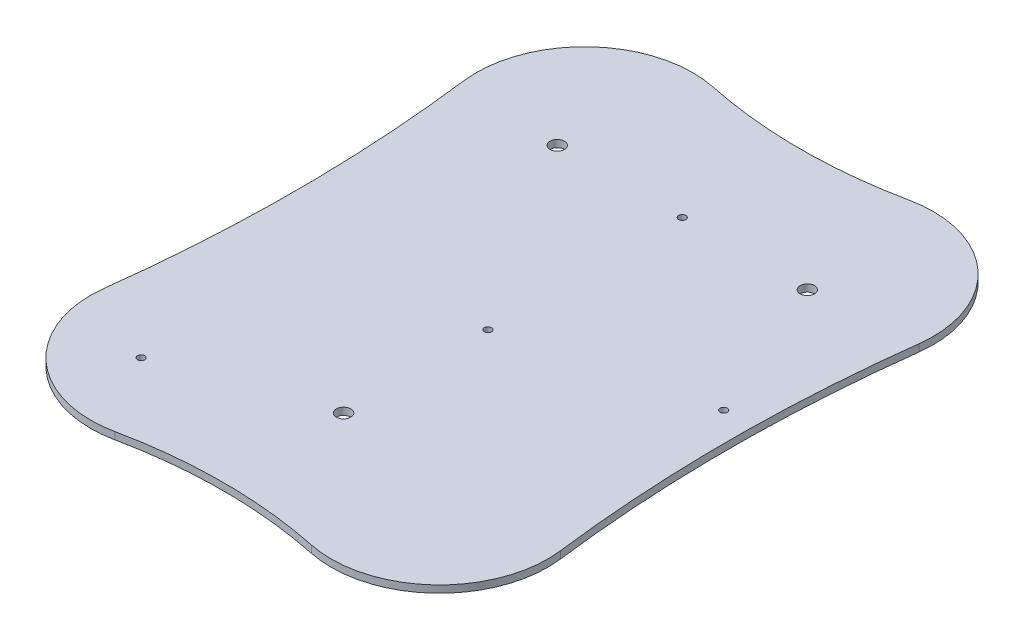
ISO-10303-21;
HEADER;
FILE_DESCRIPTION(('STEP AP214'),'2;1');
FILE_NAME('part.step','',(''),(''),'','','');
FILE_SCHEMA(('AUTOMOTIVE_DESIGN { 1 0 10303 214 1 1 1 1 }'));
ENDSEC;
DATA;
#1=APPLICATION_CONTEXT('core data for automotive mechanical design processes');
#2=APPLICATION_PROTOCOL_DEFINITION('international standard','automotive_design',2000,#1);
#3=PRODUCT_CONTEXT('',#1,'mechanical');
#4=PRODUCT('Part','Part','',(#3));
#5=PRODUCT_RELATED_PRODUCT_CATEGORY('part','',(#4));
#6=PRODUCT_DEFINITION_FORMATION('','',#4);
#7=PRODUCT_DEFINITION_CONTEXT('part definition',#1,'design');
#8=PRODUCT_DEFINITION('design','',#6,#7);
#9=PRODUCT_DEFINITION_SHAPE('','',#8);
#10=(LENGTH_UNIT() NAMED_UNIT(*) SI_UNIT(.MILLI.,.METRE.));
#11=(NAMED_UNIT(*) PLANE_ANGLE_UNIT() SI_UNIT($,.RADIAN.));
#12=(NAMED_UNIT(*) SI_UNIT($,.STERADIAN.) SOLID_ANGLE_UNIT());
#13=UNCERTAINTY_MEASURE_WITH_UNIT(LENGTH_MEASURE(1.E-05),#10,'distance_accuracy_value','');
#14=(GEOMETRIC_REPRESENTATION_CONTEXT(3) GLOBAL_UNCERTAINTY_ASSIGNED_CONTEXT((#13)) GLOBAL_UNIT_ASSIGNED_CONTEXT((#10,
#11,#12)) REPRESENTATION_CONTEXT('',''));
#15=CARTESIAN_POINT('',(0.,0.,0.));
#16=DIRECTION('',(0.,0.,1.));
#17=DIRECTION('',(1.,0.,0.));
#18=AXIS2_PLACEMENT_3D('',#15,#16,#17);
#19=CARTESIAN_POINT('',(-185.000006532533,1.5,25.0390765857744));
#20=DIRECTION('',(0.,-1.,0.));
#21=DIRECTION('',(0.,0.,-1.));
#22=AXIS2_PLACEMENT_3D('',#19,#20,#21);
#23=PLANE('',#22);
#24=CARTESIAN_POINT('',(38.9999999999999,1.5,0.));
#25=DIRECTION('',(0.,1.,0.));
#26=DIRECTION('',(0.,0.,1.));
#27=AXIS2_PLACEMENT_3D('',#24,#25,#26);
#28=CIRCLE('',#27,0.749999999999999);
#29=CARTESIAN_POINT('',(38.9999999999999,1.5,0.749999999999999));
#30=VERTEX_POINT('',#29);
#31=EDGE_CURVE('E214',#30,#30,#28,.T.);
#32=ORIENTED_EDGE('',*,*,#31,.F.);
#33=EDGE_LOOP('',(#32));
#34=FACE_BOUND('',#33,.T.);
#35=CARTESIAN_POINT('',(-31.0104207051516,1.5,51.0885608116344));
#36=DIRECTION('',(0.,1.,0.));
#37=DIRECTION('',(0.,0.,1.));
#38=AXIS2_PLACEMENT_3D('',#35,#36,#37);
#39=CIRCLE('',#38,0.750000000000007);
#40=CARTESIAN_POINT('',(-31.0104207051516,1.5,51.8385608116344));
#41=VERTEX_POINT('',#40);
#42=EDGE_CURVE('E208',#41,#41,#39,.T.);
#43=ORIENTED_EDGE('',*,*,#42,.F.);
#44=EDGE_LOOP('',(#43));
#45=FACE_BOUND('',#44,.T.);
#46=CARTESIAN_POINT('',(0.,1.5,10.));
#47=DIRECTION('',(0.,1.,0.));
#48=DIRECTION('',(0.,0.,1.));
#49=AXIS2_PLACEMENT_3D('',#46,#47,#48);
#50=CIRCLE('',#49,0.75);
#51=CARTESIAN_POINT('',(0.,1.5,10.75));
#52=VERTEX_POINT('',#51);
#53=EDGE_CURVE('E202',#52,#52,#50,.T.);
#54=ORIENTED_EDGE('',*,*,#53,.F.);
#55=EDGE_LOOP('',(#54));
#56=FACE_BOUND('',#55,.T.);
#57=CARTESIAN_POINT('',(0.,1.5,-30.3973683071413));
#58=DIRECTION('',(0.,1.,0.));
#59=DIRECTION('',(0.,0.,1.));
#60=AXIS2_PLACEMENT_3D('',#57,#58,#59);
#61=CIRCLE('',#60,0.75);
#62=CARTESIAN_POINT('',(0.,1.5,-29.6473683071413));
#63=VERTEX_POINT('',#62);
#64=EDGE_CURVE('E196',#63,#63,#61,.T.);
#65=ORIENTED_EDGE('',*,*,#64,.F.);
#66=EDGE_LOOP('',(#65));
#67=FACE_BOUND('',#66,.T.);
#68=CARTESIAN_POINT('',(-25.000013065066,1.5,45.0781531715487));
#69=DIRECTION('',(0.,1.,0.));
#70=DIRECTION('',(0.,0.,-1.));
#71=AXIS2_PLACEMENT_3D('',#68,#69,#70);
#72=CIRCLE('',#71,22.5);
#73=CARTESIAN_POINT('',(-47.3255935488986,1.5,42.2820029502779));
#74=VERTEX_POINT('',#73);
#75=CARTESIAN_POINT('',(-20.4081739306661,1.5,67.1046148339173));
#76=VERTEX_POINT('',#75);
#77=EDGE_CURVE('E144',#74,#76,#72,.T.);
#78=ORIENTED_EDGE('',*,*,#77,.T.);
#79=CARTESIAN_POINT('',(0.,1.5,165.));
#80=DIRECTION('',(0.,-1.,0.));
#81=DIRECTION('',(0.,0.,-1.));
#82=AXIS2_PLACEMENT_3D('',#79,#80,#81);
#83=CIRCLE('',#82,100.);
#84=CARTESIAN_POINT('',(20.4081739306661,1.5,67.1046148339173));
#85=VERTEX_POINT('',#84);
#86=EDGE_CURVE('E92',#76,#85,#83,.T.);
#87=ORIENTED_EDGE('',*,*,#86,.T.);
#88=CARTESIAN_POINT('',(25.000013065066,1.5,45.0781531715487));
#89=DIRECTION('',(0.,1.,0.));
#90=DIRECTION('',(0.,0.,1.));
#91=AXIS2_PLACEMENT_3D('',#88,#89,#90);
#92=CIRCLE('',#91,22.5);
#93=CARTESIAN_POINT('',(47.3255935488986,1.5,42.2820029502779));
#94=VERTEX_POINT('',#93);
#95=EDGE_CURVE('E159',#85,#94,#92,.T.);
#96=ORIENTED_EDGE('',*,*,#95,.T.);
#97=CARTESIAN_POINT('',(345.,1.5,5.));
#98=DIRECTION('',(0.,-1.,0.));
#99=DIRECTION('',(0.,0.,1.));
#100=AXIS2_PLACEMENT_3D('',#97,#98,#99);
#101=CIRCLE('',#100,300.);
#102=CARTESIAN_POINT('',(47.3255935488986,1.5,-32.2820029502779));
#103=VERTEX_POINT('',#102);
#104=EDGE_CURVE('E172',#94,#103,#101,.T.);
#105=ORIENTED_EDGE('',*,*,#104,.T.);
#106=CARTESIAN_POINT('',(25.000013065066,1.5,-35.0781531715487));
#107=DIRECTION('',(0.,1.,0.));
#108=DIRECTION('',(0.,0.,-1.));
#109=AXIS2_PLACEMENT_3D('',#106,#107,#108);
#110=CIRCLE('',#109,22.5);
#111=CARTESIAN_POINT('',(20.4081739306661,1.5,-57.1046148339173));
#112=VERTEX_POINT('',#111);
#113=EDGE_CURVE('E111',#103,#112,#110,.T.);
#114=ORIENTED_EDGE('',*,*,#113,.T.);
#115=CARTESIAN_POINT('',(0.,1.5,-155.));
#116=DIRECTION('',(0.,-1.,0.));
#117=DIRECTION('',(0.,0.,1.));
#118=AXIS2_PLACEMENT_3D('',#115,#116,#117);
#119=CIRCLE('',#118,100.);
#120=CARTESIAN_POINT('',(-20.4081739306661,1.5,-57.1046148339173));
#121=VERTEX_POINT('',#120);
#122=EDGE_CURVE('E105',#112,#121,#119,.T.);
#123=ORIENTED_EDGE('',*,*,#122,.T.);
#124=CARTESIAN_POINT('',(-25.000013065066,1.5,-35.0781531715487));
#125=DIRECTION('',(0.,1.,0.));
#126=DIRECTION('',(0.,0.,1.));
#127=AXIS2_PLACEMENT_3D('',#124,#125,#126);
#128=CIRCLE('',#127,22.5);
#129=CARTESIAN_POINT('',(-47.3255935488986,1.5,-32.2820029502779));
#130=VERTEX_POINT('',#129);
#131=EDGE_CURVE('E109',#121,#130,#128,.T.);
#132=ORIENTED_EDGE('',*,*,#131,.T.);
#133=CARTESIAN_POINT('',(-345.,1.5,5.));
#134=DIRECTION('',(0.,-1.,0.));
#135=DIRECTION('',(0.,0.,-1.));
#136=AXIS2_PLACEMENT_3D('',#133,#134,#135);
#137=CIRCLE('',#136,300.);
#138=EDGE_CURVE('E49',#130,#74,#137,.T.);
#139=ORIENTED_EDGE('',*,*,#138,.T.);
#140=EDGE_LOOP('',(#78,#87,#96,#105,#114,#123,#132,#139));
#141=FACE_BOUND('',#140,.T.);
#142=CARTESIAN_POINT('',(-26.,1.5,-30.3973683071413));
#143=DIRECTION('',(0.,1.,0.));
#144=DIRECTION('',(0.,0.,1.));
#145=AXIS2_PLACEMENT_3D('',#142,#143,#144);
#146=CIRCLE('',#145,1.5);
#147=CARTESIAN_POINT('',(-26.,1.5,-28.8973683071413));
#148=VERTEX_POINT('',#147);
#149=EDGE_CURVE('E133',#148,#148,#146,.T.);
#150=ORIENTED_EDGE('',*,*,#149,.F.);
#151=EDGE_LOOP('',(#150));
#152=FACE_BOUND('',#151,.T.);
#153=CARTESIAN_POINT('',(26.,1.5,-30.3973683071413));
#154=DIRECTION('',(0.,1.,0.));
#155=DIRECTION('',(0.,0.,1.));
#156=AXIS2_PLACEMENT_3D('',#153,#154,#155);
#157=CIRCLE('',#156,1.5);
#158=CARTESIAN_POINT('',(26.,1.5,-28.8973683071413));
#159=VERTEX_POINT('',#158);
#160=EDGE_CURVE('E181',#159,#159,#157,.T.);
#161=ORIENTED_EDGE('',*,*,#160,.F.);
#162=EDGE_LOOP('',(#161));
#163=FACE_BOUND('',#162,.T.);
#164=CARTESIAN_POINT('',(0.,1.5,40.));
#165=DIRECTION('',(0.,1.,0.));
#166=DIRECTION('',(0.,0.,1.));
#167=AXIS2_PLACEMENT_3D('',#164,#165,#166);
#168=CIRCLE('',#167,1.5);
#169=CARTESIAN_POINT('',(0.,1.5,41.5));
#170=VERTEX_POINT('',#169);
#171=EDGE_CURVE('E187',#170,#170,#168,.T.);
#172=ORIENTED_EDGE('',*,*,#171,.F.);
#173=EDGE_LOOP('',(#172));
#174=FACE_BOUND('',#173,.T.);
#175=ADVANCED_FACE('F32',(#34,#45,#56,#67,#141,#152,#163,#174),#23,.F.);
#176=CARTESIAN_POINT('',(-185.000006532533,0.,25.0390765857744));
#177=DIRECTION('',(0.,-1.,0.));
#178=DIRECTION('',(0.,0.,-1.));
#179=AXIS2_PLACEMENT_3D('',#176,#177,#178);
#180=PLANE('',#179);
#181=CARTESIAN_POINT('',(38.9999999999999,0.,0.));
#182=DIRECTION('',(0.,1.,0.));
#183=DIRECTION('',(0.,0.,1.));
#184=AXIS2_PLACEMENT_3D('',#181,#182,#183);
#185=CIRCLE('',#184,0.749999999999999);
#186=CARTESIAN_POINT('',(38.9999999999999,0.,0.749999999999999));
#187=VERTEX_POINT('',#186);
#188=EDGE_CURVE('E211',#187,#187,#185,.T.);
#189=ORIENTED_EDGE('',*,*,#188,.T.);
#190=EDGE_LOOP('',(#189));
#191=FACE_BOUND('',#190,.T.);
#192=CARTESIAN_POINT('',(-31.0104207051516,0.,51.0885608116344));
#193=DIRECTION('',(0.,1.,0.));
#194=DIRECTION('',(0.,0.,1.));
#195=AXIS2_PLACEMENT_3D('',#192,#193,#194);
#196=CIRCLE('',#195,0.750000000000007);
#197=CARTESIAN_POINT('',(-31.0104207051516,0.,51.8385608116344));
#198=VERTEX_POINT('',#197);
#199=EDGE_CURVE('E205',#198,#198,#196,.T.);
#200=ORIENTED_EDGE('',*,*,#199,.T.);
#201=EDGE_LOOP('',(#200));
#202=FACE_BOUND('',#201,.T.);
#203=CARTESIAN_POINT('',(0.,0.,10.));
#204=DIRECTION('',(0.,1.,0.));
#205=DIRECTION('',(0.,0.,1.));
#206=AXIS2_PLACEMENT_3D('',#203,#204,#205);
#207=CIRCLE('',#206,0.75);
#208=CARTESIAN_POINT('',(0.,0.,10.75));
#209=VERTEX_POINT('',#208);
#210=EDGE_CURVE('E199',#209,#209,#207,.T.);
#211=ORIENTED_EDGE('',*,*,#210,.T.);
#212=EDGE_LOOP('',(#211));
#213=FACE_BOUND('',#212,.T.);
#214=CARTESIAN_POINT('',(0.,0.,-30.3973683071413));
#215=DIRECTION('',(0.,1.,0.));
#216=DIRECTION('',(0.,0.,1.));
#217=AXIS2_PLACEMENT_3D('',#214,#215,#216);
#218=CIRCLE('',#217,0.75);
#219=CARTESIAN_POINT('',(0.,0.,-29.6473683071413));
#220=VERTEX_POINT('',#219);
#221=EDGE_CURVE('E193',#220,#220,#218,.T.);
#222=ORIENTED_EDGE('',*,*,#221,.T.);
#223=EDGE_LOOP('',(#222));
#224=FACE_BOUND('',#223,.T.);
#225=CARTESIAN_POINT('',(26.,0.,-30.3973683071413));
#226=DIRECTION('',(0.,1.,0.));
#227=DIRECTION('',(0.,0.,1.));
#228=AXIS2_PLACEMENT_3D('',#225,#226,#227);
#229=CIRCLE('',#228,1.5);
#230=CARTESIAN_POINT('',(26.,0.,-28.8973683071413));
#231=VERTEX_POINT('',#230);
#232=EDGE_CURVE('E184',#231,#231,#229,.T.);
#233=ORIENTED_EDGE('',*,*,#232,.T.);
#234=EDGE_LOOP('',(#233));
#235=FACE_BOUND('',#234,.T.);
#236=CARTESIAN_POINT('',(-25.000013065066,0.,45.0781531715487));
#237=DIRECTION('',(0.,1.,0.));
#238=DIRECTION('',(0.,0.,-1.));
#239=AXIS2_PLACEMENT_3D('',#236,#237,#238);
#240=CIRCLE('',#239,22.5);
#241=CARTESIAN_POINT('',(-47.3255935488986,0.,42.2820029502779));
#242=VERTEX_POINT('',#241);
#243=CARTESIAN_POINT('',(-20.4081739306661,0.,67.1046148339173));
#244=VERTEX_POINT('',#243);
#245=EDGE_CURVE('E129',#242,#244,#240,.T.);
#246=ORIENTED_EDGE('',*,*,#245,.F.);
#247=CARTESIAN_POINT('',(-345.,0.,5.));
#248=DIRECTION('',(0.,-1.,0.));
#249=DIRECTION('',(0.,0.,-1.));
#250=AXIS2_PLACEMENT_3D('',#247,#248,#249);
#251=CIRCLE('',#250,300.);
#252=CARTESIAN_POINT('',(-47.3255935488986,0.,-32.2820029502779));
#253=VERTEX_POINT('',#252);
#254=EDGE_CURVE('E84',#253,#242,#251,.T.);
#255=ORIENTED_EDGE('',*,*,#254,.F.);
#256=CARTESIAN_POINT('',(-25.000013065066,0.,-35.0781531715487));
#257=DIRECTION('',(0.,1.,0.));
#258=DIRECTION('',(0.,0.,1.));
#259=AXIS2_PLACEMENT_3D('',#256,#257,#258);
#260=CIRCLE('',#259,22.5);
#261=CARTESIAN_POINT('',(-20.4081739306661,0.,-57.1046148339173));
#262=VERTEX_POINT('',#261);
#263=EDGE_CURVE('E78',#262,#253,#260,.T.);
#264=ORIENTED_EDGE('',*,*,#263,.F.);
#265=CARTESIAN_POINT('',(0.,0.,-155.));
#266=DIRECTION('',(0.,-1.,0.));
#267=DIRECTION('',(0.,0.,1.));
#268=AXIS2_PLACEMENT_3D('',#265,#266,#267);
#269=CIRCLE('',#268,100.);
#270=CARTESIAN_POINT('',(20.4081739306661,0.,-57.1046148339173));
#271=VERTEX_POINT('',#270);
#272=EDGE_CURVE('E119',#271,#262,#269,.T.);
#273=ORIENTED_EDGE('',*,*,#272,.F.);
#274=CARTESIAN_POINT('',(25.000013065066,0.,-35.0781531715487));
#275=DIRECTION('',(0.,1.,0.));
#276=DIRECTION('',(0.,0.,-1.));
#277=AXIS2_PLACEMENT_3D('',#274,#275,#276);
#278=CIRCLE('',#277,22.5);
#279=CARTESIAN_POINT('',(47.3255935488986,0.,-32.2820029502779));
#280=VERTEX_POINT('',#279);
#281=EDGE_CURVE('E139',#280,#271,#278,.T.);
#282=ORIENTED_EDGE('',*,*,#281,.F.);
#283=CARTESIAN_POINT('',(345.,0.,5.));
#284=DIRECTION('',(0.,-1.,0.));
#285=DIRECTION('',(0.,0.,1.));
#286=AXIS2_PLACEMENT_3D('',#283,#284,#285);
#287=CIRCLE('',#286,300.);
#288=CARTESIAN_POINT('',(47.3255935488986,0.,42.2820029502779));
#289=VERTEX_POINT('',#288);
#290=EDGE_CURVE('E137',#289,#280,#287,.T.);
#291=ORIENTED_EDGE('',*,*,#290,.F.);
#292=CARTESIAN_POINT('',(25.000013065066,0.,45.0781531715487));
#293=DIRECTION('',(0.,1.,0.));
#294=DIRECTION('',(0.,0.,1.));
#295=AXIS2_PLACEMENT_3D('',#292,#293,#294);
#296=CIRCLE('',#295,22.5);
#297=CARTESIAN_POINT('',(20.4081739306661,0.,67.1046148339173));
#298=VERTEX_POINT('',#297);
#299=EDGE_CURVE('E135',#298,#289,#296,.T.);
#300=ORIENTED_EDGE('',*,*,#299,.F.);
#301=CARTESIAN_POINT('',(0.,0.,165.));
#302=DIRECTION('',(0.,-1.,0.));
#303=DIRECTION('',(0.,0.,-1.));
#304=AXIS2_PLACEMENT_3D('',#301,#302,#303);
#305=CIRCLE('',#304,100.);
#306=EDGE_CURVE('E132',#244,#298,#305,.T.);
#307=ORIENTED_EDGE('',*,*,#306,.F.);
#308=EDGE_LOOP('',(#246,#255,#264,#273,#282,#291,#300,#307));
#309=FACE_BOUND('',#308,.T.);
#310=CARTESIAN_POINT('',(-26.,0.,-30.3973683071413));
#311=DIRECTION('',(0.,1.,0.));
#312=DIRECTION('',(0.,0.,1.));
#313=AXIS2_PLACEMENT_3D('',#310,#311,#312);
#314=CIRCLE('',#313,1.5);
#315=CARTESIAN_POINT('',(-26.,0.,-28.8973683071413));
#316=VERTEX_POINT('',#315);
#317=EDGE_CURVE('E178',#316,#316,#314,.T.);
#318=ORIENTED_EDGE('',*,*,#317,.T.);
#319=EDGE_LOOP('',(#318));
#320=FACE_BOUND('',#319,.T.);
#321=CARTESIAN_POINT('',(0.,0.,40.));
#322=DIRECTION('',(0.,1.,0.));
#323=DIRECTION('',(0.,0.,1.));
#324=AXIS2_PLACEMENT_3D('',#321,#322,#323);
#325=CIRCLE('',#324,1.5);
#326=CARTESIAN_POINT('',(0.,0.,41.5));
#327=VERTEX_POINT('',#326);
#328=EDGE_CURVE('E190',#327,#327,#325,.T.);
#329=ORIENTED_EDGE('',*,*,#328,.T.);
#330=EDGE_LOOP('',(#329));
#331=FACE_BOUND('',#330,.T.);
#332=ADVANCED_FACE('F163',(#191,#202,#213,#224,#235,#309,#320,#331),#180,.T.);
#333=CARTESIAN_POINT('',(-25.000013065066,1.5,45.0781531715487));
#334=DIRECTION('',(0.,-1.,0.));
#335=DIRECTION('',(0.,0.,-1.));
#336=AXIS2_PLACEMENT_3D('',#333,#334,#335);
#337=CYLINDRICAL_SURFACE('',#336,22.5);
#338=ORIENTED_EDGE('',*,*,#245,.T.);
#339=DIRECTION('',(0.,-1.,0.));
#340=VECTOR('',#339,1.);
#341=CARTESIAN_POINT('',(-20.4081739306661,1.5,67.1046148339173));
#342=LINE('',#341,#340);
#343=EDGE_CURVE('E11',#76,#244,#342,.T.);
#344=ORIENTED_EDGE('',*,*,#343,.F.);
#345=ORIENTED_EDGE('',*,*,#77,.F.);
#346=DIRECTION('',(0.,-1.,0.));
#347=VECTOR('',#346,1.);
#348=CARTESIAN_POINT('',(-47.3255935488986,1.5,42.2820029502779));
#349=LINE('',#348,#347);
#350=EDGE_CURVE('E125',#74,#242,#349,.T.);
#351=ORIENTED_EDGE('',*,*,#350,.T.);
#352=EDGE_LOOP('',(#338,#344,#345,#351));
#353=FACE_BOUND('',#352,.T.);
#354=ADVANCED_FACE('F34',(#353),#337,.T.);
#355=CARTESIAN_POINT('',(0.,1.5,165.));
#356=DIRECTION('',(0.,-1.,0.));
#357=DIRECTION('',(0.,0.,-1.));
#358=AXIS2_PLACEMENT_3D('',#355,#356,#357);
#359=CYLINDRICAL_SURFACE('',#358,100.);
#360=ORIENTED_EDGE('',*,*,#306,.T.);
#361=DIRECTION('',(0.,-1.,0.));
#362=VECTOR('',#361,1.);
#363=CARTESIAN_POINT('',(20.4081739306661,1.5,67.1046148339173));
#364=LINE('',#363,#362);
#365=EDGE_CURVE('E41',#85,#298,#364,.T.);
#366=ORIENTED_EDGE('',*,*,#365,.F.);
#367=ORIENTED_EDGE('',*,*,#86,.F.);
#368=ORIENTED_EDGE('',*,*,#343,.T.);
#369=EDGE_LOOP('',(#360,#366,#367,#368));
#370=FACE_BOUND('',#369,.T.);
#371=ADVANCED_FACE('F277',(#370),#359,.F.);
#372=CARTESIAN_POINT('',(25.000013065066,1.5,45.0781531715487));
#373=DIRECTION('',(0.,-1.,0.));
#374=DIRECTION('',(0.,0.,-1.));
#375=AXIS2_PLACEMENT_3D('',#372,#373,#374);
#376=CYLINDRICAL_SURFACE('',#375,22.5);
#377=ORIENTED_EDGE('',*,*,#299,.T.);
#378=DIRECTION('',(0.,-1.,0.));
#379=VECTOR('',#378,1.);
#380=CARTESIAN_POINT('',(47.3255935488986,1.5,42.2820029502779));
#381=LINE('',#380,#379);
#382=EDGE_CURVE('E151',#94,#289,#381,.T.);
#383=ORIENTED_EDGE('',*,*,#382,.F.);
#384=ORIENTED_EDGE('',*,*,#95,.F.);
#385=ORIENTED_EDGE('',*,*,#365,.T.);
#386=EDGE_LOOP('',(#377,#383,#384,#385));
#387=FACE_BOUND('',#386,.T.);
#388=ADVANCED_FACE('F157',(#387),#376,.T.);
#389=CARTESIAN_POINT('',(345.,1.5,5.));
#390=DIRECTION('',(0.,-1.,0.));
#391=DIRECTION('',(0.,0.,-1.));
#392=AXIS2_PLACEMENT_3D('',#389,#390,#391);
#393=CYLINDRICAL_SURFACE('',#392,300.);
#394=ORIENTED_EDGE('',*,*,#290,.T.);
#395=DIRECTION('',(0.,-1.,0.));
#396=VECTOR('',#395,1.);
#397=CARTESIAN_POINT('',(47.3255935488986,1.5,-32.2820029502779));
#398=LINE('',#397,#396);
#399=EDGE_CURVE('E148',#103,#280,#398,.T.);
#400=ORIENTED_EDGE('',*,*,#399,.F.);
#401=ORIENTED_EDGE('',*,*,#104,.F.);
#402=ORIENTED_EDGE('',*,*,#382,.T.);
#403=EDGE_LOOP('',(#394,#400,#401,#402));
#404=FACE_BOUND('',#403,.T.);
#405=ADVANCED_FACE('F168',(#404),#393,.F.);
#406=CARTESIAN_POINT('',(25.000013065066,1.5,-35.0781531715487));
#407=DIRECTION('',(0.,-1.,0.));
#408=DIRECTION('',(0.,0.,-1.));
#409=AXIS2_PLACEMENT_3D('',#406,#407,#408);
#410=CYLINDRICAL_SURFACE('',#409,22.5);
#411=ORIENTED_EDGE('',*,*,#281,.T.);
#412=DIRECTION('',(0.,-1.,0.));
#413=VECTOR('',#412,1.);
#414=CARTESIAN_POINT('',(20.4081739306661,1.5,-57.1046148339173));
#415=LINE('',#414,#413);
#416=EDGE_CURVE('E120',#112,#271,#415,.T.);
#417=ORIENTED_EDGE('',*,*,#416,.F.);
#418=ORIENTED_EDGE('',*,*,#113,.F.);
#419=ORIENTED_EDGE('',*,*,#399,.T.);
#420=EDGE_LOOP('',(#411,#417,#418,#419));
#421=FACE_BOUND('',#420,.T.);
#422=ADVANCED_FACE('F171',(#421),#410,.T.);
#423=CARTESIAN_POINT('',(0.,1.5,-155.));
#424=DIRECTION('',(0.,-1.,0.));
#425=DIRECTION('',(0.,0.,-1.));
#426=AXIS2_PLACEMENT_3D('',#423,#424,#425);
#427=CYLINDRICAL_SURFACE('',#426,100.);
#428=ORIENTED_EDGE('',*,*,#272,.T.);
#429=DIRECTION('',(0.,-1.,0.));
#430=VECTOR('',#429,1.);
#431=CARTESIAN_POINT('',(-20.4081739306661,1.5,-57.1046148339173));
#432=LINE('',#431,#430);
#433=EDGE_CURVE('E116',#121,#262,#432,.T.);
#434=ORIENTED_EDGE('',*,*,#433,.F.);
#435=ORIENTED_EDGE('',*,*,#122,.F.);
#436=ORIENTED_EDGE('',*,*,#416,.T.);
#437=EDGE_LOOP('',(#428,#434,#435,#436));
#438=FACE_BOUND('',#437,.T.);
#439=ADVANCED_FACE('F117',(#438),#427,.F.);
#440=CARTESIAN_POINT('',(-25.000013065066,1.5,-35.0781531715487));
#441=DIRECTION('',(0.,-1.,0.));
#442=DIRECTION('',(0.,0.,-1.));
#443=AXIS2_PLACEMENT_3D('',#440,#441,#442);
#444=CYLINDRICAL_SURFACE('',#443,22.5);
#445=ORIENTED_EDGE('',*,*,#263,.T.);
#446=DIRECTION('',(0.,-1.,0.));
#447=VECTOR('',#446,1.);
#448=CARTESIAN_POINT('',(-47.3255935488986,1.5,-32.2820029502779));
#449=LINE('',#448,#447);
#450=EDGE_CURVE('E121',#130,#253,#449,.T.);
#451=ORIENTED_EDGE('',*,*,#450,.F.);
#452=ORIENTED_EDGE('',*,*,#131,.F.);
#453=ORIENTED_EDGE('',*,*,#433,.T.);
#454=EDGE_LOOP('',(#445,#451,#452,#453));
#455=FACE_BOUND('',#454,.T.);
#456=ADVANCED_FACE('F123',(#455),#444,.T.);
#457=CARTESIAN_POINT('',(-345.,1.5,5.));
#458=DIRECTION('',(0.,-1.,0.));
#459=DIRECTION('',(0.,0.,-1.));
#460=AXIS2_PLACEMENT_3D('',#457,#458,#459);
#461=CYLINDRICAL_SURFACE('',#460,300.);
#462=ORIENTED_EDGE('',*,*,#254,.T.);
#463=ORIENTED_EDGE('',*,*,#350,.F.);
#464=ORIENTED_EDGE('',*,*,#138,.F.);
#465=ORIENTED_EDGE('',*,*,#450,.T.);
#466=EDGE_LOOP('',(#462,#463,#464,#465));
#467=FACE_BOUND('',#466,.T.);
#468=ADVANCED_FACE('F261',(#467),#461,.F.);
#469=CARTESIAN_POINT('',(-26.,1.5,-30.3973683071413));
#470=DIRECTION('',(0.,-1.,0.));
#471=DIRECTION('',(0.,0.,-1.));
#472=AXIS2_PLACEMENT_3D('',#469,#470,#471);
#473=CYLINDRICAL_SURFACE('',#472,1.5);
#474=ORIENTED_EDGE('',*,*,#149,.T.);
#475=EDGE_LOOP('',(#474));
#476=FACE_BOUND('',#475,.T.);
#477=ORIENTED_EDGE('',*,*,#317,.F.);
#478=EDGE_LOOP('',(#477));
#479=FACE_BOUND('',#478,.T.);
#480=ADVANCED_FACE('F258',(#476,#479),#473,.F.);
#481=CARTESIAN_POINT('',(26.,1.5,-30.3973683071413));
#482=DIRECTION('',(0.,-1.,0.));
#483=DIRECTION('',(0.,0.,-1.));
#484=AXIS2_PLACEMENT_3D('',#481,#482,#483);
#485=CYLINDRICAL_SURFACE('',#484,1.5);
#486=ORIENTED_EDGE('',*,*,#160,.T.);
#487=EDGE_LOOP('',(#486));
#488=FACE_BOUND('',#487,.T.);
#489=ORIENTED_EDGE('',*,*,#232,.F.);
#490=EDGE_LOOP('',(#489));
#491=FACE_BOUND('',#490,.T.);
#492=ADVANCED_FACE('F250',(#488,#491),#485,.F.);
#493=CARTESIAN_POINT('',(0.,1.5,40.));
#494=DIRECTION('',(0.,-1.,0.));
#495=DIRECTION('',(0.,0.,-1.));
#496=AXIS2_PLACEMENT_3D('',#493,#494,#495);
#497=CYLINDRICAL_SURFACE('',#496,1.5);
#498=ORIENTED_EDGE('',*,*,#171,.T.);
#499=EDGE_LOOP('',(#498));
#500=FACE_BOUND('',#499,.T.);
#501=ORIENTED_EDGE('',*,*,#328,.F.);
#502=EDGE_LOOP('',(#501));
#503=FACE_BOUND('',#502,.T.);
#504=ADVANCED_FACE('F241',(#500,#503),#497,.F.);
#505=CARTESIAN_POINT('',(0.,0.,-30.3973683071413));
#506=DIRECTION('',(0.,1.,0.));
#507=DIRECTION('',(0.,0.,1.));
#508=AXIS2_PLACEMENT_3D('',#505,#506,#507);
#509=CYLINDRICAL_SURFACE('',#508,0.75);
#510=ORIENTED_EDGE('',*,*,#221,.F.);
#511=EDGE_LOOP('',(#510));
#512=FACE_BOUND('',#511,.T.);
#513=ORIENTED_EDGE('',*,*,#64,.T.);
#514=EDGE_LOOP('',(#513));
#515=FACE_BOUND('',#514,.T.);
#516=ADVANCED_FACE('F238',(#512,#515),#509,.F.);
#517=CARTESIAN_POINT('',(0.,0.,10.));
#518=DIRECTION('',(0.,1.,0.));
#519=DIRECTION('',(0.,0.,1.));
#520=AXIS2_PLACEMENT_3D('',#517,#518,#519);
#521=CYLINDRICAL_SURFACE('',#520,0.75);
#522=ORIENTED_EDGE('',*,*,#210,.F.);
#523=EDGE_LOOP('',(#522));
#524=FACE_BOUND('',#523,.T.);
#525=ORIENTED_EDGE('',*,*,#53,.T.);
#526=EDGE_LOOP('',(#525));
#527=FACE_BOUND('',#526,.T.);
#528=ADVANCED_FACE('F240',(#524,#527),#521,.F.);
#529=CARTESIAN_POINT('',(-31.0104207051516,0.,51.0885608116344));
#530=DIRECTION('',(0.,1.,0.));
#531=DIRECTION('',(0.,0.,1.));
#532=AXIS2_PLACEMENT_3D('',#529,#530,#531);
#533=CYLINDRICAL_SURFACE('',#532,0.750000000000007);
#534=ORIENTED_EDGE('',*,*,#199,.F.);
#535=EDGE_LOOP('',(#534));
#536=FACE_BOUND('',#535,.T.);
#537=ORIENTED_EDGE('',*,*,#42,.T.);
#538=EDGE_LOOP('',(#537));
#539=FACE_BOUND('',#538,.T.);
#540=ADVANCED_FACE('F225',(#536,#539),#533,.F.);
#541=CARTESIAN_POINT('',(38.9999999999999,0.,0.));
#542=DIRECTION('',(0.,1.,0.));
#543=DIRECTION('',(0.,0.,1.));
#544=AXIS2_PLACEMENT_3D('',#541,#542,#543);
#545=CYLINDRICAL_SURFACE('',#544,0.749999999999999);
#546=ORIENTED_EDGE('',*,*,#188,.F.);
#547=EDGE_LOOP('',(#546));
#548=FACE_BOUND('',#547,.T.);
#549=ORIENTED_EDGE('',*,*,#31,.T.);
#550=EDGE_LOOP('',(#549));
#551=FACE_BOUND('',#550,.T.);
#552=ADVANCED_FACE('F222',(#548,#551),#545,.F.);
#553=CLOSED_SHELL('',(#175,#332,#354,#371,#388,#405,#422,#439,#456,#468,#480,#492,#504,#516,
#528,#540,#552));
#554=MANIFOLD_SOLID_BREP('B2',#553);
#555=ADVANCED_BREP_SHAPE_REPRESENTATION('',(#18,#554),#14);
#556=SHAPE_DEFINITION_REPRESENTATION(#9,#555);
ENDSEC;
END-ISO-10303-21;
